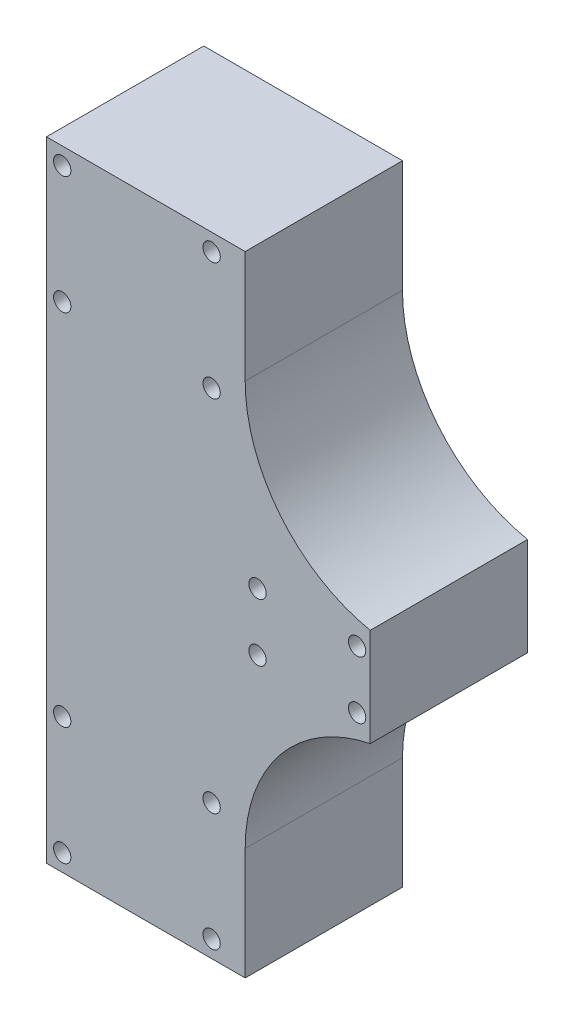
ISO-10303-21;
HEADER;
FILE_DESCRIPTION(('STEP AP214'),'2;1');
FILE_NAME('part.step','',(''),(''),'','','');
FILE_SCHEMA(('AUTOMOTIVE_DESIGN { 1 0 10303 214 1 1 1 1 }'));
ENDSEC;
DATA;
#1=APPLICATION_CONTEXT('core data for automotive mechanical design processes');
#2=APPLICATION_PROTOCOL_DEFINITION('international standard','automotive_design',2000,#1);
#3=PRODUCT_CONTEXT('',#1,'mechanical');
#4=PRODUCT('Part','Part','',(#3));
#5=PRODUCT_RELATED_PRODUCT_CATEGORY('part','',(#4));
#6=PRODUCT_DEFINITION_FORMATION('','',#4);
#7=PRODUCT_DEFINITION_CONTEXT('part definition',#1,'design');
#8=PRODUCT_DEFINITION('design','',#6,#7);
#9=PRODUCT_DEFINITION_SHAPE('','',#8);
#10=(LENGTH_UNIT() NAMED_UNIT(*) SI_UNIT(.MILLI.,.METRE.));
#11=(NAMED_UNIT(*) PLANE_ANGLE_UNIT() SI_UNIT($,.RADIAN.));
#12=(NAMED_UNIT(*) SI_UNIT($,.STERADIAN.) SOLID_ANGLE_UNIT());
#13=UNCERTAINTY_MEASURE_WITH_UNIT(LENGTH_MEASURE(1.E-05),#10,'distance_accuracy_value','');
#14=(GEOMETRIC_REPRESENTATION_CONTEXT(3) GLOBAL_UNCERTAINTY_ASSIGNED_CONTEXT((#13)) GLOBAL_UNIT_ASSIGNED_CONTEXT((#10,
#11,#12)) REPRESENTATION_CONTEXT('',''));
#15=CARTESIAN_POINT('',(0.,0.,0.));
#16=DIRECTION('',(0.,0.,1.));
#17=DIRECTION('',(1.,0.,0.));
#18=AXIS2_PLACEMENT_3D('',#15,#16,#17);
#19=CARTESIAN_POINT('',(0.,2378.54856685235,60.));
#20=DIRECTION('',(0.,1.,0.));
#21=DIRECTION('',(0.,0.,1.));
#22=AXIS2_PLACEMENT_3D('',#19,#20,#21);
#23=PLANE('',#22);
#24=DIRECTION('',(1.,0.,0.));
#25=VECTOR('',#24,1.);
#26=CARTESIAN_POINT('',(0.,2378.54856685235,0.));
#27=LINE('',#26,#25);
#28=CARTESIAN_POINT('',(895.499999999689,2378.54856685235,0.));
#29=VERTEX_POINT('',#28);
#30=CARTESIAN_POINT('',(971.299999999427,2378.54856685235,0.));
#31=VERTEX_POINT('',#30);
#32=EDGE_CURVE('E130',#29,#31,#27,.T.);
#33=ORIENTED_EDGE('',*,*,#32,.F.);
#34=DIRECTION('',(0.,0.,-1.));
#35=VECTOR('',#34,1.);
#36=CARTESIAN_POINT('',(895.499999999689,2378.54856685235,60.));
#37=LINE('',#36,#35);
#38=CARTESIAN_POINT('',(895.499999999689,2378.54856685235,60.));
#39=VERTEX_POINT('',#38);
#40=EDGE_CURVE('E11',#39,#29,#37,.T.);
#41=ORIENTED_EDGE('',*,*,#40,.F.);
#42=DIRECTION('',(1.,0.,0.));
#43=VECTOR('',#42,1.);
#44=CARTESIAN_POINT('',(0.,2378.54856685235,60.));
#45=LINE('',#44,#43);
#46=CARTESIAN_POINT('',(971.299999999427,2378.54856685235,60.));
#47=VERTEX_POINT('',#46);
#48=EDGE_CURVE('E149',#39,#47,#45,.T.);
#49=ORIENTED_EDGE('',*,*,#48,.T.);
#50=DIRECTION('',(0.,0.,-1.));
#51=VECTOR('',#50,1.);
#52=CARTESIAN_POINT('',(971.299999999427,2378.54856685235,60.));
#53=LINE('',#52,#51);
#54=EDGE_CURVE('E51',#47,#31,#53,.T.);
#55=ORIENTED_EDGE('',*,*,#54,.T.);
#56=EDGE_LOOP('',(#33,#41,#49,#55));
#57=FACE_BOUND('',#56,.T.);
#58=ADVANCED_FACE('F35',(#57),#23,.T.);
#59=CARTESIAN_POINT('',(895.499999999875,7.37368499592563E-11,60.));
#60=DIRECTION('',(1.,0.,0.));
#61=DIRECTION('',(0.,1.,0.));
#62=AXIS2_PLACEMENT_3D('',#59,#60,#61);
#63=PLANE('',#62);
#64=DIRECTION('',(0.,-1.,0.));
#65=VECTOR('',#64,1.);
#66=CARTESIAN_POINT('',(895.499999999875,7.37368499592563E-11,0.));
#67=LINE('',#66,#65);
#68=CARTESIAN_POINT('',(895.499999999689,2138.54856685227,0.));
#69=VERTEX_POINT('',#68);
#70=EDGE_CURVE('E132',#29,#69,#67,.T.);
#71=ORIENTED_EDGE('',*,*,#70,.T.);
#72=DIRECTION('',(0.,0.,-1.));
#73=VECTOR('',#72,1.);
#74=CARTESIAN_POINT('',(895.499999999689,2138.54856685227,60.));
#75=LINE('',#74,#73);
#76=CARTESIAN_POINT('',(895.499999999689,2138.54856685227,60.));
#77=VERTEX_POINT('',#76);
#78=EDGE_CURVE('E43',#77,#69,#75,.T.);
#79=ORIENTED_EDGE('',*,*,#78,.F.);
#80=DIRECTION('',(0.,-1.,0.));
#81=VECTOR('',#80,1.);
#82=CARTESIAN_POINT('',(895.499999999875,7.37368499592563E-11,60.));
#83=LINE('',#82,#81);
#84=EDGE_CURVE('E175',#39,#77,#83,.T.);
#85=ORIENTED_EDGE('',*,*,#84,.F.);
#86=ORIENTED_EDGE('',*,*,#40,.T.);
#87=EDGE_LOOP('',(#71,#79,#85,#86));
#88=FACE_BOUND('',#87,.T.);
#89=ADVANCED_FACE('F296',(#88),#63,.F.);
#90=CARTESIAN_POINT('',(0.,2138.54856685227,60.));
#91=DIRECTION('',(0.,1.,0.));
#92=DIRECTION('',(0.,0.,1.));
#93=AXIS2_PLACEMENT_3D('',#90,#91,#92);
#94=PLANE('',#93);
#95=DIRECTION('',(1.,0.,0.));
#96=VECTOR('',#95,1.);
#97=CARTESIAN_POINT('',(0.,2138.54856685227,0.));
#98=LINE('',#97,#96);
#99=CARTESIAN_POINT('',(971.299999999427,2138.54856685227,0.));
#100=VERTEX_POINT('',#99);
#101=EDGE_CURVE('E135',#69,#100,#98,.T.);
#102=ORIENTED_EDGE('',*,*,#101,.T.);
#103=DIRECTION('',(0.,0.,-1.));
#104=VECTOR('',#103,1.);
#105=CARTESIAN_POINT('',(971.299999999427,2138.54856685227,60.));
#106=LINE('',#105,#104);
#107=CARTESIAN_POINT('',(971.299999999427,2138.54856685227,60.));
#108=VERTEX_POINT('',#107);
#109=EDGE_CURVE('E155',#108,#100,#106,.T.);
#110=ORIENTED_EDGE('',*,*,#109,.F.);
#111=DIRECTION('',(1.,0.,0.));
#112=VECTOR('',#111,1.);
#113=CARTESIAN_POINT('',(0.,2138.54856685227,60.));
#114=LINE('',#113,#112);
#115=EDGE_CURVE('E164',#77,#108,#114,.T.);
#116=ORIENTED_EDGE('',*,*,#115,.F.);
#117=ORIENTED_EDGE('',*,*,#78,.T.);
#118=EDGE_LOOP('',(#102,#110,#116,#117));
#119=FACE_BOUND('',#118,.T.);
#120=ADVANCED_FACE('F162',(#119),#94,.F.);
#121=CARTESIAN_POINT('',(971.299999999427,0.,60.));
#122=DIRECTION('',(-1.,0.,0.));
#123=DIRECTION('',(0.,0.,1.));
#124=AXIS2_PLACEMENT_3D('',#121,#122,#123);
#125=PLANE('',#124);
#126=DIRECTION('',(0.,1.,0.));
#127=VECTOR('',#126,1.);
#128=CARTESIAN_POINT('',(971.299999999427,0.,0.));
#129=LINE('',#128,#127);
#130=CARTESIAN_POINT('',(971.299999999427,2181.3478019429,0.));
#131=VERTEX_POINT('',#130);
#132=EDGE_CURVE('E137',#100,#131,#129,.T.);
#133=ORIENTED_EDGE('',*,*,#132,.T.);
#134=DIRECTION('',(0.,0.,-1.));
#135=VECTOR('',#134,1.);
#136=CARTESIAN_POINT('',(971.299999999427,2181.3478019429,60.));
#137=LINE('',#136,#135);
#138=CARTESIAN_POINT('',(971.299999999427,2181.3478019429,60.));
#139=VERTEX_POINT('',#138);
#140=EDGE_CURVE('E153',#139,#131,#137,.T.);
#141=ORIENTED_EDGE('',*,*,#140,.F.);
#142=DIRECTION('',(0.,1.,0.));
#143=VECTOR('',#142,1.);
#144=CARTESIAN_POINT('',(971.299999999427,0.,60.));
#145=LINE('',#144,#143);
#146=EDGE_CURVE('E125',#108,#139,#145,.T.);
#147=ORIENTED_EDGE('',*,*,#146,.F.);
#148=ORIENTED_EDGE('',*,*,#109,.T.);
#149=EDGE_LOOP('',(#133,#141,#147,#148));
#150=FACE_BOUND('',#149,.T.);
#151=ADVANCED_FACE('F173',(#150),#125,.F.);
#152=CARTESIAN_POINT('',(1031.00076490889,2181.3478019429,60.));
#153=DIRECTION('',(0.,0.,-1.));
#154=DIRECTION('',(-1.,0.,0.));
#155=AXIS2_PLACEMENT_3D('',#152,#153,#154);
#156=CYLINDRICAL_SURFACE('',#155,59.7007649094633);
#157=CARTESIAN_POINT('',(1031.00076490889,2181.3478019429,0.));
#158=DIRECTION('',(0.,0.,1.));
#159=DIRECTION('',(1.,0.,0.));
#160=AXIS2_PLACEMENT_3D('',#157,#158,#159);
#161=CIRCLE('',#160,59.7007649094633);
#162=CARTESIAN_POINT('',(1018.99999999943,2239.82996137945,0.));
#163=VERTEX_POINT('',#162);
#164=EDGE_CURVE('E140',#163,#131,#161,.T.);
#165=ORIENTED_EDGE('',*,*,#164,.F.);
#166=DIRECTION('',(0.,0.,-1.));
#167=VECTOR('',#166,1.);
#168=CARTESIAN_POINT('',(1018.99999999943,2239.82996137945,60.));
#169=LINE('',#168,#167);
#170=CARTESIAN_POINT('',(1018.99999999943,2239.82996137945,60.));
#171=VERTEX_POINT('',#170);
#172=EDGE_CURVE('E111',#171,#163,#169,.T.);
#173=ORIENTED_EDGE('',*,*,#172,.F.);
#174=CARTESIAN_POINT('',(1031.00076490889,2181.3478019429,60.));
#175=DIRECTION('',(0.,0.,1.));
#176=DIRECTION('',(1.,0.,0.));
#177=AXIS2_PLACEMENT_3D('',#174,#175,#176);
#178=CIRCLE('',#177,59.7007649094633);
#179=EDGE_CURVE('E123',#171,#139,#178,.T.);
#180=ORIENTED_EDGE('',*,*,#179,.T.);
#181=ORIENTED_EDGE('',*,*,#140,.T.);
#182=EDGE_LOOP('',(#165,#173,#180,#181));
#183=FACE_BOUND('',#182,.T.);
#184=ADVANCED_FACE('F309',(#183),#156,.F.);
#185=CARTESIAN_POINT('',(1018.99999999943,0.,60.));
#186=DIRECTION('',(1.,0.,0.));
#187=DIRECTION('',(0.,0.,-1.));
#188=AXIS2_PLACEMENT_3D('',#185,#186,#187);
#189=PLANE('',#188);
#190=DIRECTION('',(0.,-1.,0.));
#191=VECTOR('',#190,1.);
#192=CARTESIAN_POINT('',(1018.99999999943,0.,0.));
#193=LINE('',#192,#191);
#194=CARTESIAN_POINT('',(1018.99999999943,2277.26717232517,0.));
#195=VERTEX_POINT('',#194);
#196=EDGE_CURVE('E108',#195,#163,#193,.T.);
#197=ORIENTED_EDGE('',*,*,#196,.F.);
#198=DIRECTION('',(0.,0.,-1.));
#199=VECTOR('',#198,1.);
#200=CARTESIAN_POINT('',(1018.99999999943,2277.26717232517,60.));
#201=LINE('',#200,#199);
#202=CARTESIAN_POINT('',(1018.99999999943,2277.26717232517,60.));
#203=VERTEX_POINT('',#202);
#204=EDGE_CURVE('E102',#203,#195,#201,.T.);
#205=ORIENTED_EDGE('',*,*,#204,.F.);
#206=DIRECTION('',(0.,-1.,0.));
#207=VECTOR('',#206,1.);
#208=CARTESIAN_POINT('',(1018.99999999943,0.,60.));
#209=LINE('',#208,#207);
#210=EDGE_CURVE('E106',#203,#171,#209,.T.);
#211=ORIENTED_EDGE('',*,*,#210,.T.);
#212=ORIENTED_EDGE('',*,*,#172,.T.);
#213=EDGE_LOOP('',(#197,#205,#211,#212));
#214=FACE_BOUND('',#213,.T.);
#215=ADVANCED_FACE('F104',(#214),#189,.T.);
#216=CARTESIAN_POINT('',(1031.00076490889,2335.74933176172,60.));
#217=DIRECTION('',(0.,0.,-1.));
#218=DIRECTION('',(-1.,0.,0.));
#219=AXIS2_PLACEMENT_3D('',#216,#217,#218);
#220=CYLINDRICAL_SURFACE('',#219,59.7007649094633);
#221=CARTESIAN_POINT('',(1031.00076490889,2335.74933176172,0.));
#222=DIRECTION('',(0.,0.,1.));
#223=DIRECTION('',(1.,0.,0.));
#224=AXIS2_PLACEMENT_3D('',#221,#222,#223);
#225=CIRCLE('',#224,59.7007649094633);
#226=CARTESIAN_POINT('',(971.299999999427,2335.74933176172,0.));
#227=VERTEX_POINT('',#226);
#228=EDGE_CURVE('E144',#195,#227,#225,.F.);
#229=ORIENTED_EDGE('',*,*,#228,.T.);
#230=DIRECTION('',(0.,0.,-1.));
#231=VECTOR('',#230,1.);
#232=CARTESIAN_POINT('',(971.299999999427,2335.74933176172,60.));
#233=LINE('',#232,#231);
#234=CARTESIAN_POINT('',(971.299999999427,2335.74933176172,60.));
#235=VERTEX_POINT('',#234);
#236=EDGE_CURVE('E77',#235,#227,#233,.T.);
#237=ORIENTED_EDGE('',*,*,#236,.F.);
#238=CARTESIAN_POINT('',(1031.00076490889,2335.74933176172,60.));
#239=DIRECTION('',(0.,0.,1.));
#240=DIRECTION('',(1.,0.,0.));
#241=AXIS2_PLACEMENT_3D('',#238,#239,#240);
#242=CIRCLE('',#241,59.7007649094633);
#243=EDGE_CURVE('E113',#203,#235,#242,.F.);
#244=ORIENTED_EDGE('',*,*,#243,.F.);
#245=ORIENTED_EDGE('',*,*,#204,.T.);
#246=EDGE_LOOP('',(#229,#237,#244,#245));
#247=FACE_BOUND('',#246,.T.);
#248=ADVANCED_FACE('F114',(#247),#220,.F.);
#249=CARTESIAN_POINT('',(971.299999999427,0.,60.));
#250=DIRECTION('',(1.,0.,0.));
#251=DIRECTION('',(0.,0.,-1.));
#252=AXIS2_PLACEMENT_3D('',#249,#250,#251);
#253=PLANE('',#252);
#254=DIRECTION('',(0.,-1.,0.));
#255=VECTOR('',#254,1.);
#256=CARTESIAN_POINT('',(971.299999999427,0.,0.));
#257=LINE('',#256,#255);
#258=EDGE_CURVE('E146',#31,#227,#257,.T.);
#259=ORIENTED_EDGE('',*,*,#258,.F.);
#260=ORIENTED_EDGE('',*,*,#54,.F.);
#261=DIRECTION('',(0.,-1.,0.));
#262=VECTOR('',#261,1.);
#263=CARTESIAN_POINT('',(971.299999999427,0.,60.));
#264=LINE('',#263,#262);
#265=EDGE_CURVE('E117',#47,#235,#264,.T.);
#266=ORIENTED_EDGE('',*,*,#265,.T.);
#267=ORIENTED_EDGE('',*,*,#236,.T.);
#268=EDGE_LOOP('',(#259,#260,#266,#267));
#269=FACE_BOUND('',#268,.T.);
#270=ADVANCED_FACE('F256',(#269),#253,.T.);
#271=CARTESIAN_POINT('',(0.,0.,60.));
#272=DIRECTION('',(0.,0.,1.));
#273=DIRECTION('',(1.,0.,0.));
#274=AXIS2_PLACEMENT_3D('',#271,#272,#273);
#275=PLANE('',#274);
#276=CARTESIAN_POINT('',(901.499999999699,2145.04856685232,60.));
#277=DIRECTION('',(0.,0.,1.));
#278=DIRECTION('',(1.,0.,0.));
#279=AXIS2_PLACEMENT_3D('',#276,#277,#278);
#280=CIRCLE('',#279,3.29999999999997);
#281=CARTESIAN_POINT('',(904.799999999699,2145.04856685232,60.));
#282=VERTEX_POINT('',#281);
#283=EDGE_CURVE('E248',#282,#282,#280,.T.);
#284=ORIENTED_EDGE('',*,*,#283,.F.);
#285=EDGE_LOOP('',(#284));
#286=FACE_BOUND('',#285,.T.);
#287=CARTESIAN_POINT('',(958.499999999699,2145.04856685232,60.));
#288=DIRECTION('',(0.,0.,1.));
#289=DIRECTION('',(1.,0.,0.));
#290=AXIS2_PLACEMENT_3D('',#287,#288,#289);
#291=CIRCLE('',#290,3.29999999999997);
#292=CARTESIAN_POINT('',(961.799999999699,2145.04856685232,60.));
#293=VERTEX_POINT('',#292);
#294=EDGE_CURVE('E242',#293,#293,#291,.T.);
#295=ORIENTED_EDGE('',*,*,#294,.F.);
#296=EDGE_LOOP('',(#295));
#297=FACE_BOUND('',#296,.T.);
#298=CARTESIAN_POINT('',(958.499999999699,2190.04856685232,60.));
#299=DIRECTION('',(0.,0.,1.));
#300=DIRECTION('',(1.,0.,0.));
#301=AXIS2_PLACEMENT_3D('',#298,#299,#300);
#302=CIRCLE('',#301,3.29999999999997);
#303=CARTESIAN_POINT('',(961.799999999699,2190.04856685232,60.));
#304=VERTEX_POINT('',#303);
#305=EDGE_CURVE('E236',#304,#304,#302,.T.);
#306=ORIENTED_EDGE('',*,*,#305,.F.);
#307=EDGE_LOOP('',(#306));
#308=FACE_BOUND('',#307,.T.);
#309=CARTESIAN_POINT('',(901.499999999699,2190.04856685232,60.));
#310=DIRECTION('',(0.,0.,1.));
#311=DIRECTION('',(1.,0.,0.));
#312=AXIS2_PLACEMENT_3D('',#309,#310,#311);
#313=CIRCLE('',#312,3.29999999999997);
#314=CARTESIAN_POINT('',(904.799999999699,2190.04856685232,60.));
#315=VERTEX_POINT('',#314);
#316=EDGE_CURVE('E230',#315,#315,#313,.T.);
#317=ORIENTED_EDGE('',*,*,#316,.F.);
#318=EDGE_LOOP('',(#317));
#319=FACE_BOUND('',#318,.T.);
#320=CARTESIAN_POINT('',(901.499999999679,2372.0485668523,60.));
#321=DIRECTION('',(0.,0.,1.));
#322=DIRECTION('',(1.,0.,0.));
#323=AXIS2_PLACEMENT_3D('',#320,#321,#322);
#324=CIRCLE('',#323,3.29999999999997);
#325=CARTESIAN_POINT('',(904.799999999679,2372.0485668523,60.));
#326=VERTEX_POINT('',#325);
#327=EDGE_CURVE('E224',#326,#326,#324,.T.);
#328=ORIENTED_EDGE('',*,*,#327,.F.);
#329=EDGE_LOOP('',(#328));
#330=FACE_BOUND('',#329,.T.);
#331=CARTESIAN_POINT('',(901.49999999968,2327.0485668523,60.));
#332=DIRECTION('',(0.,0.,1.));
#333=DIRECTION('',(1.,0.,0.));
#334=AXIS2_PLACEMENT_3D('',#331,#332,#333);
#335=CIRCLE('',#334,3.29999999999997);
#336=CARTESIAN_POINT('',(904.799999999679,2327.0485668523,60.));
#337=VERTEX_POINT('',#336);
#338=EDGE_CURVE('E218',#337,#337,#335,.T.);
#339=ORIENTED_EDGE('',*,*,#338,.F.);
#340=EDGE_LOOP('',(#339));
#341=FACE_BOUND('',#340,.T.);
#342=CARTESIAN_POINT('',(958.49999999968,2327.0485668523,60.));
#343=DIRECTION('',(0.,0.,1.));
#344=DIRECTION('',(1.,0.,0.));
#345=AXIS2_PLACEMENT_3D('',#342,#343,#344);
#346=CIRCLE('',#345,3.29999999999997);
#347=CARTESIAN_POINT('',(961.799999999679,2327.0485668523,60.));
#348=VERTEX_POINT('',#347);
#349=EDGE_CURVE('E212',#348,#348,#346,.T.);
#350=ORIENTED_EDGE('',*,*,#349,.F.);
#351=EDGE_LOOP('',(#350));
#352=FACE_BOUND('',#351,.T.);
#353=CARTESIAN_POINT('',(958.49999999968,2372.0485668523,60.));
#354=DIRECTION('',(0.,0.,1.));
#355=DIRECTION('',(1.,0.,0.));
#356=AXIS2_PLACEMENT_3D('',#353,#354,#355);
#357=CIRCLE('',#356,3.29999999999997);
#358=CARTESIAN_POINT('',(961.799999999679,2372.0485668523,60.));
#359=VERTEX_POINT('',#358);
#360=EDGE_CURVE('E206',#359,#359,#357,.T.);
#361=ORIENTED_EDGE('',*,*,#360,.F.);
#362=EDGE_LOOP('',(#361));
#363=FACE_BOUND('',#362,.T.);
#364=CARTESIAN_POINT('',(1013.99999999943,2247.54856685226,60.));
#365=DIRECTION('',(0.,0.,1.));
#366=DIRECTION('',(1.,0.,0.));
#367=AXIS2_PLACEMENT_3D('',#364,#365,#366);
#368=CIRCLE('',#367,3.30000000000008);
#369=CARTESIAN_POINT('',(1017.29999999943,2247.54856685226,60.));
#370=VERTEX_POINT('',#369);
#371=EDGE_CURVE('E200',#370,#370,#368,.T.);
#372=ORIENTED_EDGE('',*,*,#371,.F.);
#373=EDGE_LOOP('',(#372));
#374=FACE_BOUND('',#373,.T.);
#375=CARTESIAN_POINT('',(1013.99999999943,2269.54856685226,60.));
#376=DIRECTION('',(0.,0.,1.));
#377=DIRECTION('',(1.,0.,0.));
#378=AXIS2_PLACEMENT_3D('',#375,#376,#377);
#379=CIRCLE('',#378,3.30000000000008);
#380=CARTESIAN_POINT('',(1017.29999999943,2269.54856685226,60.));
#381=VERTEX_POINT('',#380);
#382=EDGE_CURVE('E194',#381,#381,#379,.T.);
#383=ORIENTED_EDGE('',*,*,#382,.F.);
#384=EDGE_LOOP('',(#383));
#385=FACE_BOUND('',#384,.T.);
#386=CARTESIAN_POINT('',(975.999999999427,2247.54856685226,60.));
#387=DIRECTION('',(0.,0.,1.));
#388=DIRECTION('',(1.,0.,0.));
#389=AXIS2_PLACEMENT_3D('',#386,#387,#388);
#390=CIRCLE('',#389,3.29999999999997);
#391=CARTESIAN_POINT('',(979.299999999427,2247.54856685226,60.));
#392=VERTEX_POINT('',#391);
#393=EDGE_CURVE('E188',#392,#392,#390,.T.);
#394=ORIENTED_EDGE('',*,*,#393,.F.);
#395=EDGE_LOOP('',(#394));
#396=FACE_BOUND('',#395,.T.);
#397=CARTESIAN_POINT('',(975.999999999427,2269.54856685226,60.));
#398=DIRECTION('',(0.,0.,1.));
#399=DIRECTION('',(1.,0.,0.));
#400=AXIS2_PLACEMENT_3D('',#397,#398,#399);
#401=CIRCLE('',#400,3.29999999999997);
#402=CARTESIAN_POINT('',(979.299999999427,2269.54856685226,60.));
#403=VERTEX_POINT('',#402);
#404=EDGE_CURVE('E182',#403,#403,#401,.T.);
#405=ORIENTED_EDGE('',*,*,#404,.F.);
#406=EDGE_LOOP('',(#405));
#407=FACE_BOUND('',#406,.T.);
#408=ORIENTED_EDGE('',*,*,#48,.F.);
#409=ORIENTED_EDGE('',*,*,#84,.T.);
#410=ORIENTED_EDGE('',*,*,#115,.T.);
#411=ORIENTED_EDGE('',*,*,#146,.T.);
#412=ORIENTED_EDGE('',*,*,#179,.F.);
#413=ORIENTED_EDGE('',*,*,#210,.F.);
#414=ORIENTED_EDGE('',*,*,#243,.T.);
#415=ORIENTED_EDGE('',*,*,#265,.F.);
#416=EDGE_LOOP('',(#408,#409,#410,#411,#412,#413,#414,#415));
#417=FACE_BOUND('',#416,.T.);
#418=ADVANCED_FACE('F121',(#286,#297,#308,#319,#330,#341,#352,#363,#374,#385,#396,#407,#417),
#275,.T.);
#419=CARTESIAN_POINT('',(0.,0.,0.));
#420=DIRECTION('',(0.,0.,1.));
#421=DIRECTION('',(1.,0.,0.));
#422=AXIS2_PLACEMENT_3D('',#419,#420,#421);
#423=PLANE('',#422);
#424=CARTESIAN_POINT('',(901.499999999699,2145.04856685232,0.));
#425=DIRECTION('',(0.,0.,1.));
#426=DIRECTION('',(1.,0.,0.));
#427=AXIS2_PLACEMENT_3D('',#424,#425,#426);
#428=CIRCLE('',#427,3.29999999999997);
#429=CARTESIAN_POINT('',(904.799999999699,2145.04856685232,0.));
#430=VERTEX_POINT('',#429);
#431=EDGE_CURVE('E245',#430,#430,#428,.T.);
#432=ORIENTED_EDGE('',*,*,#431,.T.);
#433=EDGE_LOOP('',(#432));
#434=FACE_BOUND('',#433,.T.);
#435=CARTESIAN_POINT('',(958.499999999699,2145.04856685232,0.));
#436=DIRECTION('',(0.,0.,1.));
#437=DIRECTION('',(1.,0.,0.));
#438=AXIS2_PLACEMENT_3D('',#435,#436,#437);
#439=CIRCLE('',#438,3.29999999999997);
#440=CARTESIAN_POINT('',(961.799999999699,2145.04856685232,0.));
#441=VERTEX_POINT('',#440);
#442=EDGE_CURVE('E239',#441,#441,#439,.T.);
#443=ORIENTED_EDGE('',*,*,#442,.T.);
#444=EDGE_LOOP('',(#443));
#445=FACE_BOUND('',#444,.T.);
#446=CARTESIAN_POINT('',(958.499999999699,2190.04856685232,0.));
#447=DIRECTION('',(0.,0.,1.));
#448=DIRECTION('',(1.,0.,0.));
#449=AXIS2_PLACEMENT_3D('',#446,#447,#448);
#450=CIRCLE('',#449,3.29999999999997);
#451=CARTESIAN_POINT('',(961.799999999699,2190.04856685232,0.));
#452=VERTEX_POINT('',#451);
#453=EDGE_CURVE('E233',#452,#452,#450,.T.);
#454=ORIENTED_EDGE('',*,*,#453,.T.);
#455=EDGE_LOOP('',(#454));
#456=FACE_BOUND('',#455,.T.);
#457=CARTESIAN_POINT('',(901.499999999699,2190.04856685232,0.));
#458=DIRECTION('',(0.,0.,1.));
#459=DIRECTION('',(1.,0.,0.));
#460=AXIS2_PLACEMENT_3D('',#457,#458,#459);
#461=CIRCLE('',#460,3.29999999999997);
#462=CARTESIAN_POINT('',(904.799999999699,2190.04856685232,0.));
#463=VERTEX_POINT('',#462);
#464=EDGE_CURVE('E227',#463,#463,#461,.T.);
#465=ORIENTED_EDGE('',*,*,#464,.T.);
#466=EDGE_LOOP('',(#465));
#467=FACE_BOUND('',#466,.T.);
#468=CARTESIAN_POINT('',(901.499999999679,2372.0485668523,0.));
#469=DIRECTION('',(0.,0.,1.));
#470=DIRECTION('',(1.,0.,0.));
#471=AXIS2_PLACEMENT_3D('',#468,#469,#470);
#472=CIRCLE('',#471,3.29999999999997);
#473=CARTESIAN_POINT('',(904.799999999679,2372.0485668523,0.));
#474=VERTEX_POINT('',#473);
#475=EDGE_CURVE('E221',#474,#474,#472,.T.);
#476=ORIENTED_EDGE('',*,*,#475,.T.);
#477=EDGE_LOOP('',(#476));
#478=FACE_BOUND('',#477,.T.);
#479=CARTESIAN_POINT('',(901.49999999968,2327.0485668523,0.));
#480=DIRECTION('',(0.,0.,1.));
#481=DIRECTION('',(1.,0.,0.));
#482=AXIS2_PLACEMENT_3D('',#479,#480,#481);
#483=CIRCLE('',#482,3.29999999999997);
#484=CARTESIAN_POINT('',(904.799999999679,2327.0485668523,0.));
#485=VERTEX_POINT('',#484);
#486=EDGE_CURVE('E215',#485,#485,#483,.T.);
#487=ORIENTED_EDGE('',*,*,#486,.T.);
#488=EDGE_LOOP('',(#487));
#489=FACE_BOUND('',#488,.T.);
#490=CARTESIAN_POINT('',(958.49999999968,2327.0485668523,0.));
#491=DIRECTION('',(0.,0.,1.));
#492=DIRECTION('',(1.,0.,0.));
#493=AXIS2_PLACEMENT_3D('',#490,#491,#492);
#494=CIRCLE('',#493,3.29999999999997);
#495=CARTESIAN_POINT('',(961.799999999679,2327.0485668523,0.));
#496=VERTEX_POINT('',#495);
#497=EDGE_CURVE('E209',#496,#496,#494,.T.);
#498=ORIENTED_EDGE('',*,*,#497,.T.);
#499=EDGE_LOOP('',(#498));
#500=FACE_BOUND('',#499,.T.);
#501=CARTESIAN_POINT('',(958.49999999968,2372.0485668523,0.));
#502=DIRECTION('',(0.,0.,1.));
#503=DIRECTION('',(1.,0.,0.));
#504=AXIS2_PLACEMENT_3D('',#501,#502,#503);
#505=CIRCLE('',#504,3.29999999999997);
#506=CARTESIAN_POINT('',(961.799999999679,2372.0485668523,0.));
#507=VERTEX_POINT('',#506);
#508=EDGE_CURVE('E203',#507,#507,#505,.T.);
#509=ORIENTED_EDGE('',*,*,#508,.T.);
#510=EDGE_LOOP('',(#509));
#511=FACE_BOUND('',#510,.T.);
#512=CARTESIAN_POINT('',(1013.99999999943,2247.54856685226,0.));
#513=DIRECTION('',(0.,0.,1.));
#514=DIRECTION('',(1.,0.,0.));
#515=AXIS2_PLACEMENT_3D('',#512,#513,#514);
#516=CIRCLE('',#515,3.30000000000008);
#517=CARTESIAN_POINT('',(1017.29999999943,2247.54856685226,0.));
#518=VERTEX_POINT('',#517);
#519=EDGE_CURVE('E197',#518,#518,#516,.T.);
#520=ORIENTED_EDGE('',*,*,#519,.T.);
#521=EDGE_LOOP('',(#520));
#522=FACE_BOUND('',#521,.T.);
#523=CARTESIAN_POINT('',(1013.99999999943,2269.54856685226,0.));
#524=DIRECTION('',(0.,0.,1.));
#525=DIRECTION('',(1.,0.,0.));
#526=AXIS2_PLACEMENT_3D('',#523,#524,#525);
#527=CIRCLE('',#526,3.30000000000008);
#528=CARTESIAN_POINT('',(1017.29999999943,2269.54856685226,0.));
#529=VERTEX_POINT('',#528);
#530=EDGE_CURVE('E191',#529,#529,#527,.T.);
#531=ORIENTED_EDGE('',*,*,#530,.T.);
#532=EDGE_LOOP('',(#531));
#533=FACE_BOUND('',#532,.T.);
#534=CARTESIAN_POINT('',(975.999999999427,2247.54856685226,0.));
#535=DIRECTION('',(0.,0.,1.));
#536=DIRECTION('',(1.,0.,0.));
#537=AXIS2_PLACEMENT_3D('',#534,#535,#536);
#538=CIRCLE('',#537,3.29999999999997);
#539=CARTESIAN_POINT('',(979.299999999427,2247.54856685226,0.));
#540=VERTEX_POINT('',#539);
#541=EDGE_CURVE('E185',#540,#540,#538,.T.);
#542=ORIENTED_EDGE('',*,*,#541,.T.);
#543=EDGE_LOOP('',(#542));
#544=FACE_BOUND('',#543,.T.);
#545=CARTESIAN_POINT('',(975.999999999427,2269.54856685226,0.));
#546=DIRECTION('',(0.,0.,1.));
#547=DIRECTION('',(1.,0.,0.));
#548=AXIS2_PLACEMENT_3D('',#545,#546,#547);
#549=CIRCLE('',#548,3.29999999999997);
#550=CARTESIAN_POINT('',(979.299999999427,2269.54856685226,0.));
#551=VERTEX_POINT('',#550);
#552=EDGE_CURVE('E133',#551,#551,#549,.T.);
#553=ORIENTED_EDGE('',*,*,#552,.T.);
#554=EDGE_LOOP('',(#553));
#555=FACE_BOUND('',#554,.T.);
#556=ORIENTED_EDGE('',*,*,#32,.T.);
#557=ORIENTED_EDGE('',*,*,#258,.T.);
#558=ORIENTED_EDGE('',*,*,#228,.F.);
#559=ORIENTED_EDGE('',*,*,#196,.T.);
#560=ORIENTED_EDGE('',*,*,#164,.T.);
#561=ORIENTED_EDGE('',*,*,#132,.F.);
#562=ORIENTED_EDGE('',*,*,#101,.F.);
#563=ORIENTED_EDGE('',*,*,#70,.F.);
#564=EDGE_LOOP('',(#556,#557,#558,#559,#560,#561,#562,#563));
#565=FACE_BOUND('',#564,.T.);
#566=ADVANCED_FACE('F169',(#434,#445,#456,#467,#478,#489,#500,#511,#522,#533,#544,#555,#565),
#423,.F.);
#567=CARTESIAN_POINT('',(975.999999999427,2269.54856685226,60.));
#568=DIRECTION('',(0.,0.,1.));
#569=DIRECTION('',(1.,0.,0.));
#570=AXIS2_PLACEMENT_3D('',#567,#568,#569);
#571=CYLINDRICAL_SURFACE('',#570,3.29999999999997);
#572=ORIENTED_EDGE('',*,*,#552,.F.);
#573=EDGE_LOOP('',(#572));
#574=FACE_BOUND('',#573,.T.);
#575=ORIENTED_EDGE('',*,*,#404,.T.);
#576=EDGE_LOOP('',(#575));
#577=FACE_BOUND('',#576,.T.);
#578=ADVANCED_FACE('F280',(#574,#577),#571,.F.);
#579=CARTESIAN_POINT('',(975.999999999427,2247.54856685226,60.));
#580=DIRECTION('',(0.,0.,1.));
#581=DIRECTION('',(1.,0.,0.));
#582=AXIS2_PLACEMENT_3D('',#579,#580,#581);
#583=CYLINDRICAL_SURFACE('',#582,3.29999999999997);
#584=ORIENTED_EDGE('',*,*,#541,.F.);
#585=EDGE_LOOP('',(#584));
#586=FACE_BOUND('',#585,.T.);
#587=ORIENTED_EDGE('',*,*,#393,.T.);
#588=EDGE_LOOP('',(#587));
#589=FACE_BOUND('',#588,.T.);
#590=ADVANCED_FACE('F282',(#586,#589),#583,.F.);
#591=CARTESIAN_POINT('',(1013.99999999943,2269.54856685226,60.));
#592=DIRECTION('',(0.,0.,1.));
#593=DIRECTION('',(1.,0.,0.));
#594=AXIS2_PLACEMENT_3D('',#591,#592,#593);
#595=CYLINDRICAL_SURFACE('',#594,3.30000000000008);
#596=ORIENTED_EDGE('',*,*,#530,.F.);
#597=EDGE_LOOP('',(#596));
#598=FACE_BOUND('',#597,.T.);
#599=ORIENTED_EDGE('',*,*,#382,.T.);
#600=EDGE_LOOP('',(#599));
#601=FACE_BOUND('',#600,.T.);
#602=ADVANCED_FACE('F289',(#598,#601),#595,.F.);
#603=CARTESIAN_POINT('',(1013.99999999943,2247.54856685226,60.));
#604=DIRECTION('',(0.,0.,1.));
#605=DIRECTION('',(1.,0.,0.));
#606=AXIS2_PLACEMENT_3D('',#603,#604,#605);
#607=CYLINDRICAL_SURFACE('',#606,3.30000000000008);
#608=ORIENTED_EDGE('',*,*,#519,.F.);
#609=EDGE_LOOP('',(#608));
#610=FACE_BOUND('',#609,.T.);
#611=ORIENTED_EDGE('',*,*,#371,.T.);
#612=EDGE_LOOP('',(#611));
#613=FACE_BOUND('',#612,.T.);
#614=ADVANCED_FACE('F371',(#610,#613),#607,.F.);
#615=CARTESIAN_POINT('',(958.49999999968,2372.0485668523,60.));
#616=DIRECTION('',(0.,0.,1.));
#617=DIRECTION('',(1.,0.,0.));
#618=AXIS2_PLACEMENT_3D('',#615,#616,#617);
#619=CYLINDRICAL_SURFACE('',#618,3.29999999999997);
#620=ORIENTED_EDGE('',*,*,#508,.F.);
#621=EDGE_LOOP('',(#620));
#622=FACE_BOUND('',#621,.T.);
#623=ORIENTED_EDGE('',*,*,#360,.T.);
#624=EDGE_LOOP('',(#623));
#625=FACE_BOUND('',#624,.T.);
#626=ADVANCED_FACE('F381',(#622,#625),#619,.F.);
#627=CARTESIAN_POINT('',(958.49999999968,2327.0485668523,60.));
#628=DIRECTION('',(0.,0.,1.));
#629=DIRECTION('',(1.,0.,0.));
#630=AXIS2_PLACEMENT_3D('',#627,#628,#629);
#631=CYLINDRICAL_SURFACE('',#630,3.29999999999997);
#632=ORIENTED_EDGE('',*,*,#497,.F.);
#633=EDGE_LOOP('',(#632));
#634=FACE_BOUND('',#633,.T.);
#635=ORIENTED_EDGE('',*,*,#349,.T.);
#636=EDGE_LOOP('',(#635));
#637=FACE_BOUND('',#636,.T.);
#638=ADVANCED_FACE('F391',(#634,#637),#631,.F.);
#639=CARTESIAN_POINT('',(901.49999999968,2327.0485668523,60.));
#640=DIRECTION('',(0.,0.,1.));
#641=DIRECTION('',(1.,0.,0.));
#642=AXIS2_PLACEMENT_3D('',#639,#640,#641);
#643=CYLINDRICAL_SURFACE('',#642,3.29999999999997);
#644=ORIENTED_EDGE('',*,*,#486,.F.);
#645=EDGE_LOOP('',(#644));
#646=FACE_BOUND('',#645,.T.);
#647=ORIENTED_EDGE('',*,*,#338,.T.);
#648=EDGE_LOOP('',(#647));
#649=FACE_BOUND('',#648,.T.);
#650=ADVANCED_FACE('F401',(#646,#649),#643,.F.);
#651=CARTESIAN_POINT('',(901.499999999679,2372.0485668523,60.));
#652=DIRECTION('',(0.,0.,1.));
#653=DIRECTION('',(1.,0.,0.));
#654=AXIS2_PLACEMENT_3D('',#651,#652,#653);
#655=CYLINDRICAL_SURFACE('',#654,3.29999999999997);
#656=ORIENTED_EDGE('',*,*,#475,.F.);
#657=EDGE_LOOP('',(#656));
#658=FACE_BOUND('',#657,.T.);
#659=ORIENTED_EDGE('',*,*,#327,.T.);
#660=EDGE_LOOP('',(#659));
#661=FACE_BOUND('',#660,.T.);
#662=ADVANCED_FACE('F411',(#658,#661),#655,.F.);
#663=CARTESIAN_POINT('',(901.499999999699,2190.04856685232,60.));
#664=DIRECTION('',(0.,0.,1.));
#665=DIRECTION('',(1.,0.,0.));
#666=AXIS2_PLACEMENT_3D('',#663,#664,#665);
#667=CYLINDRICAL_SURFACE('',#666,3.29999999999997);
#668=ORIENTED_EDGE('',*,*,#464,.F.);
#669=EDGE_LOOP('',(#668));
#670=FACE_BOUND('',#669,.T.);
#671=ORIENTED_EDGE('',*,*,#316,.T.);
#672=EDGE_LOOP('',(#671));
#673=FACE_BOUND('',#672,.T.);
#674=ADVANCED_FACE('F421',(#670,#673),#667,.F.);
#675=CARTESIAN_POINT('',(958.499999999699,2190.04856685232,60.));
#676=DIRECTION('',(0.,0.,1.));
#677=DIRECTION('',(1.,0.,0.));
#678=AXIS2_PLACEMENT_3D('',#675,#676,#677);
#679=CYLINDRICAL_SURFACE('',#678,3.29999999999997);
#680=ORIENTED_EDGE('',*,*,#453,.F.);
#681=EDGE_LOOP('',(#680));
#682=FACE_BOUND('',#681,.T.);
#683=ORIENTED_EDGE('',*,*,#305,.T.);
#684=EDGE_LOOP('',(#683));
#685=FACE_BOUND('',#684,.T.);
#686=ADVANCED_FACE('F431',(#682,#685),#679,.F.);
#687=CARTESIAN_POINT('',(958.499999999699,2145.04856685232,60.));
#688=DIRECTION('',(0.,0.,1.));
#689=DIRECTION('',(1.,0.,0.));
#690=AXIS2_PLACEMENT_3D('',#687,#688,#689);
#691=CYLINDRICAL_SURFACE('',#690,3.29999999999997);
#692=ORIENTED_EDGE('',*,*,#442,.F.);
#693=EDGE_LOOP('',(#692));
#694=FACE_BOUND('',#693,.T.);
#695=ORIENTED_EDGE('',*,*,#294,.T.);
#696=EDGE_LOOP('',(#695));
#697=FACE_BOUND('',#696,.T.);
#698=ADVANCED_FACE('F441',(#694,#697),#691,.F.);
#699=CARTESIAN_POINT('',(901.499999999699,2145.04856685232,60.));
#700=DIRECTION('',(0.,0.,1.));
#701=DIRECTION('',(1.,0.,0.));
#702=AXIS2_PLACEMENT_3D('',#699,#700,#701);
#703=CYLINDRICAL_SURFACE('',#702,3.29999999999997);
#704=ORIENTED_EDGE('',*,*,#431,.F.);
#705=EDGE_LOOP('',(#704));
#706=FACE_BOUND('',#705,.T.);
#707=ORIENTED_EDGE('',*,*,#283,.T.);
#708=EDGE_LOOP('',(#707));
#709=FACE_BOUND('',#708,.T.);
#710=ADVANCED_FACE('F252',(#706,#709),#703,.F.);
#711=CLOSED_SHELL('',(#58,#89,#120,#151,#184,#215,#248,#270,#418,#566,#578,#590,#602,#614,#626,
#638,#650,#662,#674,#686,#698,#710));
#712=MANIFOLD_SOLID_BREP('B2',#711);
#713=ADVANCED_BREP_SHAPE_REPRESENTATION('',(#18,#712),#14);
#714=SHAPE_DEFINITION_REPRESENTATION(#9,#713);
ENDSEC;
END-ISO-10303-21;
